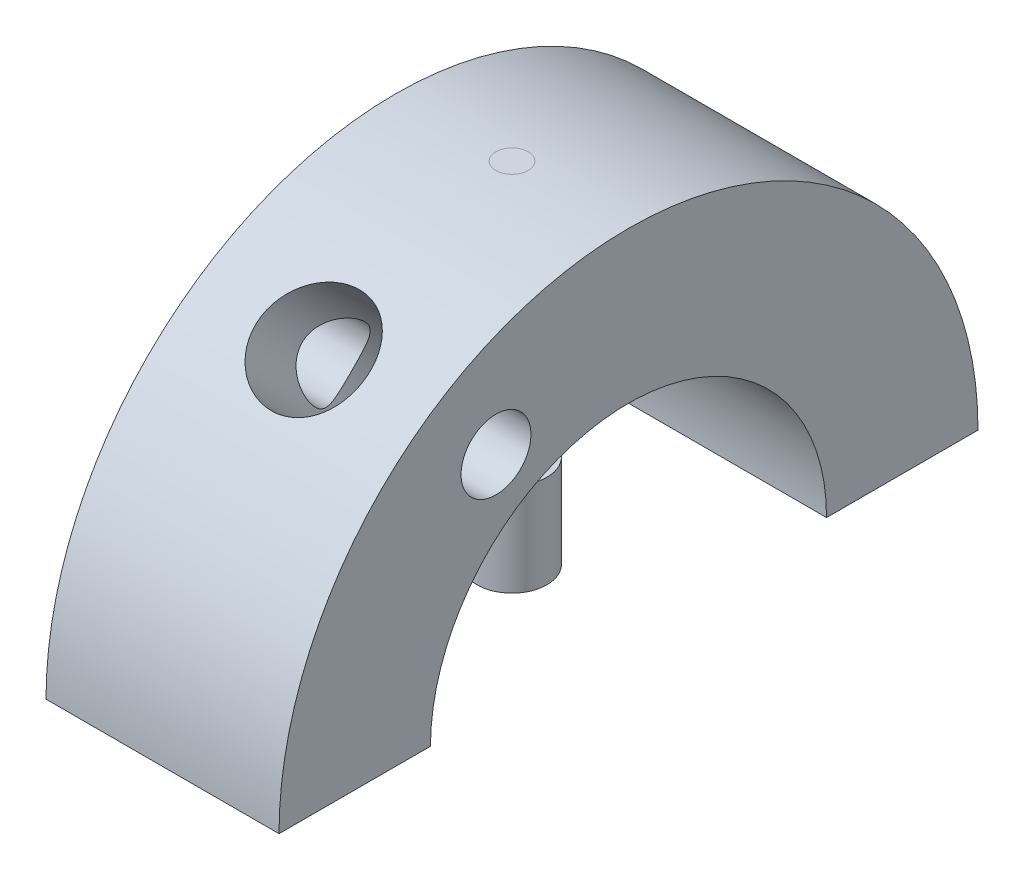
ISO-10303-21;
HEADER;
FILE_DESCRIPTION(('STEP AP214'),'2;1');
FILE_NAME('part.step','',(''),(''),'','','');
FILE_SCHEMA(('AUTOMOTIVE_DESIGN { 1 0 10303 214 1 1 1 1 }'));
ENDSEC;
DATA;
#1=APPLICATION_CONTEXT('core data for automotive mechanical design processes');
#2=APPLICATION_PROTOCOL_DEFINITION('international standard','automotive_design',2000,#1);
#3=PRODUCT_CONTEXT('',#1,'mechanical');
#4=PRODUCT('Part','Part','',(#3));
#5=PRODUCT_RELATED_PRODUCT_CATEGORY('part','',(#4));
#6=PRODUCT_DEFINITION_FORMATION('','',#4);
#7=PRODUCT_DEFINITION_CONTEXT('part definition',#1,'design');
#8=PRODUCT_DEFINITION('design','',#6,#7);
#9=PRODUCT_DEFINITION_SHAPE('','',#8);
#10=(LENGTH_UNIT() NAMED_UNIT(*) SI_UNIT(.MILLI.,.METRE.));
#11=(NAMED_UNIT(*) PLANE_ANGLE_UNIT() SI_UNIT($,.RADIAN.));
#12=(NAMED_UNIT(*) SI_UNIT($,.STERADIAN.) SOLID_ANGLE_UNIT());
#13=UNCERTAINTY_MEASURE_WITH_UNIT(LENGTH_MEASURE(1.E-05),#10,'distance_accuracy_value','');
#14=(GEOMETRIC_REPRESENTATION_CONTEXT(3) GLOBAL_UNCERTAINTY_ASSIGNED_CONTEXT((#13)) GLOBAL_UNIT_ASSIGNED_CONTEXT((#10,
#11,#12)) REPRESENTATION_CONTEXT('',''));
#15=CARTESIAN_POINT('',(0.,0.,0.));
#16=DIRECTION('',(0.,0.,1.));
#17=DIRECTION('',(1.,0.,0.));
#18=AXIS2_PLACEMENT_3D('',#15,#16,#17);
#19=CARTESIAN_POINT('',(5.,4.71939157702453,2.84369169369423));
#20=DIRECTION('',(-1.,0.,0.));
#21=DIRECTION('',(0.,0.,1.));
#22=AXIS2_PLACEMENT_3D('',#19,#20,#21);
#23=CYLINDRICAL_SURFACE('',#22,0.75000000000004);
#24=CARTESIAN_POINT('',(3.49816225997058,4.71939157702453,3.59369169369427));
#25=CARTESIAN_POINT('',(3.48237212943933,4.67736396111229,3.59369289298277));
#26=CARTESIAN_POINT('',(3.46624591516442,4.6354628448524,3.59016862420385));
#27=CARTESIAN_POINT('',(3.43487477704927,4.55241755000423,3.57608183252369));
#28=CARTESIAN_POINT('',(3.41963122359208,4.51127461265265,3.56550866824495));
#29=CARTESIAN_POINT('',(3.39449175583129,4.4378545444608,3.5397251222914));
#30=CARTESIAN_POINT('',(3.38412739388799,4.40532334575282,3.52570432936178));
#31=CARTESIAN_POINT('',(3.36654412734135,4.34195429182068,3.49277640099904));
#32=CARTESIAN_POINT('',(3.35931888166515,4.31111313391921,3.47387924023808));
#33=CARTESIAN_POINT('',(3.34910438377939,4.25174202860566,3.43118645824184));
#34=CARTESIAN_POINT('',(3.34615531979401,4.22323635421569,3.40734674039403));
#35=CARTESIAN_POINT('',(3.34522443028787,4.17004900254024,3.35564547767005));
#36=CARTESIAN_POINT('',(3.34724117411191,4.14536622605099,3.32778509332978));
#37=CARTESIAN_POINT('',(3.35522179453892,4.10376336776317,3.27324411703564));
#38=CARTESIAN_POINT('',(3.36060548033694,4.08624271962958,3.24692707629194));
#39=CARTESIAN_POINT('',(3.37403808335899,4.05487241921787,3.19282438887733));
#40=CARTESIAN_POINT('',(3.38208949648278,4.04102622665533,3.16503738746179));
#41=CARTESIAN_POINT('',(3.40370003976544,4.01213211459998,3.09697720753481));
#42=CARTESIAN_POINT('',(3.41816700781691,3.99888960836257,3.05622595793514));
#43=CARTESIAN_POINT('',(3.44869686017129,3.97951111088094,2.97362371921428));
#44=CARTESIAN_POINT('',(3.46476246085175,3.97338744771444,2.93177095028921));
#45=CARTESIAN_POINT('',(3.49698954182701,3.96818270721996,2.84701004923407));
#46=CARTESIAN_POINT('',(3.51314940313484,3.9691975088883,2.80409529421488));
#47=CARTESIAN_POINT('',(3.54378596275056,3.97866365693903,2.71851055604212));
#48=CARTESIAN_POINT('',(3.55826497102016,3.98710465735402,2.6758403154497));
#49=CARTESIAN_POINT('',(3.58209384194274,4.00969168439556,2.59835851516028));
#50=CARTESIAN_POINT('',(3.59189207114356,4.02273419236296,2.56336476708593));
#51=CARTESIAN_POINT('',(3.60849852410238,4.05424275862494,2.49514353852549));
#52=CARTESIAN_POINT('',(3.61530859811178,4.072705448913,2.461914976281));
#53=CARTESIAN_POINT('',(3.62533718902761,4.11488477667376,2.39811342092209));
#54=CARTESIAN_POINT('',(3.6285379725357,4.13862667534068,2.36755421449405));
#55=CARTESIAN_POINT('',(3.63095427809722,4.19063922894926,2.31038800414979));
#56=CARTESIAN_POINT('',(3.63017081286046,4.2189087313029,2.28377999769356));
#57=CARTESIAN_POINT('',(3.62493748160135,4.27645161057037,2.23742870899553));
#58=CARTESIAN_POINT('',(3.62079940833965,4.30544378176656,2.21729762156338));
#59=CARTESIAN_POINT('',(3.60960535647501,4.3655302894997,2.18149381618334));
#60=CARTESIAN_POINT('',(3.60254881696616,4.39662502917201,2.16582195624121));
#61=CARTESIAN_POINT('',(3.58567655930094,4.46155715825464,2.13848332957282));
#62=CARTESIAN_POINT('',(3.57575026487852,4.49545497813821,2.12703032289721));
#63=CARTESIAN_POINT('',(3.55401240924106,4.56394196604911,2.10912389423604));
#64=CARTESIAN_POINT('',(3.54220033084236,4.5985313214497,2.10267184663357));
#65=CARTESIAN_POINT('',(3.51557652463702,4.67312792667596,2.09404130614981));
#66=CARTESIAN_POINT('',(3.50058148677714,4.71316188263108,2.09265859347055));
#67=CARTESIAN_POINT('',(3.47032361144534,4.79291947487792,2.09623523392138));
#68=CARTESIAN_POINT('',(3.455060296278,4.83264232568673,2.10120734017921));
#69=CARTESIAN_POINT('',(3.42386440343967,4.91613211416066,2.11854839176209));
#70=CARTESIAN_POINT('',(3.40808509474779,4.95978681352525,2.13176118834984));
#71=CARTESIAN_POINT('',(3.38051916598163,5.04496805618071,2.16649436946363));
#72=CARTESIAN_POINT('',(3.36871877958408,5.08650150630369,2.18798554757666));
#73=CARTESIAN_POINT('',(3.35453151268342,5.15288844556569,2.23083148512887));
#74=CARTESIAN_POINT('',(3.35033322354781,5.17878512434709,2.24997290142108));
#75=CARTESIAN_POINT('',(3.34557480723508,5.22807036989122,2.29161995062206));
#76=CARTESIAN_POINT('',(3.34501056221703,5.25146174590671,2.31412174618172));
#77=CARTESIAN_POINT('',(3.34760451736375,5.2950225200128,2.36182788357609));
#78=CARTESIAN_POINT('',(3.35076072169672,5.31519363901896,2.38703076982212));
#79=CARTESIAN_POINT('',(3.36031865537089,5.35190863435309,2.43940421676841));
#80=CARTESIAN_POINT('',(3.36672499150669,5.36844731418543,2.46657752339127));
#81=CARTESIAN_POINT('',(3.38431858221963,5.4021927095608,2.53069787695271));
#82=CARTESIAN_POINT('',(3.39636736356799,5.41807220596621,2.56810355267684));
#83=CARTESIAN_POINT('',(3.42280641820984,5.44349355761178,2.64421177465048));
#84=CARTESIAN_POINT('',(3.43720000051477,5.45302635817711,2.68291609135947));
#85=CARTESIAN_POINT('',(3.46701021380882,5.46598751652316,2.76173811658616));
#86=CARTESIAN_POINT('',(3.48244037695926,5.46930566938387,2.80186871024396));
#87=CARTESIAN_POINT('',(3.51270525311873,5.46947420437673,2.88237766076776));
#88=CARTESIAN_POINT('',(3.52753988250086,5.4663236813718,2.92275605151885));
#89=CARTESIAN_POINT('',(3.55692034363959,5.45265576460819,3.00760694395679));
#90=CARTESIAN_POINT('',(3.57125016806707,5.44135728513431,3.05203479249311));
#91=CARTESIAN_POINT('',(3.59599394033441,5.41033800225419,3.13901448135212));
#92=CARTESIAN_POINT('',(3.60641300538522,5.39062827764204,3.18156870844883));
#93=CARTESIAN_POINT('',(3.62090660434441,5.34631823885664,3.2573552962954));
#94=CARTESIAN_POINT('',(3.62565515452885,5.32275896174129,3.29106580336747));
#95=CARTESIAN_POINT('',(3.63068391566726,5.27023349542392,3.35433683931741));
#96=CARTESIAN_POINT('',(3.63096855093179,5.24127268864834,3.38390144849546));
#97=CARTESIAN_POINT('',(3.62731355588333,5.18323694166521,3.43413317957378));
#98=CARTESIAN_POINT('',(3.62393201237798,5.15469191100719,3.45546101844147));
#99=CARTESIAN_POINT('',(3.61410163741132,5.09525144997067,3.49367476888427));
#100=CARTESIAN_POINT('',(3.60765165389877,5.06435514046332,3.51055900840089));
#101=CARTESIAN_POINT('',(3.59199454748339,5.00025323959976,3.54003516619758));
#102=CARTESIAN_POINT('',(3.58272098605011,4.96700875404357,3.5525059597763));
#103=CARTESIAN_POINT('',(3.56216971256512,4.89972380938075,3.57253500237752));
#104=CARTESIAN_POINT('',(3.55089345777201,4.86568394456756,3.58009680492362));
#105=CARTESIAN_POINT('',(3.52596915449089,4.79421027852521,3.59090378420293));
#106=CARTESIAN_POINT('',(3.51219849165238,4.75675094861493,3.5936906276175));
#107=CARTESIAN_POINT('',(3.49816225997058,4.71939157702453,3.59369169369427));
#108=B_SPLINE_CURVE_WITH_KNOTS('',3,(#24,#25,#26,#27,#28,#29,#30,#31,#32,#33,#34,#35,#36,#37,
#38,#39,#40,#41,#42,#43,#44,#45,#46,#47,#48,#49,#50,#51,#52,#53,#54,#55,#56,#57,#58,#59,#60,#61,
#62,#63,#64,#65,#66,#67,#68,#69,#70,#71,#72,#73,#74,#75,#76,#77,#78,#79,#80,#81,#82,#83,#84,#85,
#86,#87,#88,#89,#90,#91,#92,#93,#94,#95,#96,#97,#98,#99,#100,#101,#102,#103,#104,#105,#106,
#107),.UNSPECIFIED.,.T.,.F.,(4,2,2,2,2,2,2,2,2,2,2,2,2,2,2,2,2,2,2,2,2,2,2,2,2,2,2,2,2,2,2,2,2,
2,2,2,2,2,2,2,2,4),(0.,0.134560488140848,0.269324577150457,0.379634868166853,0.489721282434197,
0.600835746311971,0.711918201724937,0.807743328874952,0.903658363434937,1.03861946689358,
1.17381394311348,1.31082769349624,1.44765086198446,1.56299660323653,1.67827082182157,
1.79410897841395,1.90991769292547,2.01605071390278,2.12220414228444,2.23316963269999,
2.34416560828254,2.47198188729179,2.60005507680382,2.74407366307326,2.88758873295769,
2.98458946918224,3.08148027168855,3.1783191208537,3.27529561622293,3.40177220870495,
3.52842885776014,3.65731100256988,3.78621118259463,3.92946144716935,4.07252361051078,
4.19597104572783,4.31929612100794,4.42618048152388,4.53310500367232,4.64277044295141,
4.75235640875996,4.87197050460438),.UNSPECIFIED.);
#109=CARTESIAN_POINT('',(3.49816225997058,4.71939157702453,3.59369169369427));
#110=VERTEX_POINT('',#109);
#111=EDGE_CURVE('E104',#110,#110,#108,.T.);
#112=ORIENTED_EDGE('',*,*,#111,.F.);
#113=EDGE_LOOP('',(#112));
#114=FACE_BOUND('',#113,.T.);
#115=CARTESIAN_POINT('',(5.,4.71939157702453,2.84369169369423));
#116=DIRECTION('',(1.,0.,0.));
#117=DIRECTION('',(0.,0.,-1.));
#118=AXIS2_PLACEMENT_3D('',#115,#116,#117);
#119=CIRCLE('',#118,0.75000000000004);
#120=CARTESIAN_POINT('',(5.,4.71939157702453,2.09369169369419));
#121=VERTEX_POINT('',#120);
#122=EDGE_CURVE('E208',#121,#121,#119,.T.);
#123=ORIENTED_EDGE('',*,*,#122,.T.);
#124=EDGE_LOOP('',(#123));
#125=FACE_BOUND('',#124,.T.);
#126=ADVANCED_FACE('F35',(#114,#125),#23,.F.);
#127=CARTESIAN_POINT('',(5.,0.,0.));
#128=DIRECTION('',(1.,0.,0.));
#129=DIRECTION('',(0.,0.,-1.));
#130=AXIS2_PLACEMENT_3D('',#127,#128,#129);
#131=PLANE('',#130);
#132=CARTESIAN_POINT('',(5.,0.,0.));
#133=DIRECTION('',(1.,0.,0.));
#134=DIRECTION('',(0.,0.,-1.));
#135=AXIS2_PLACEMENT_3D('',#132,#133,#134);
#136=CIRCLE('',#135,7.5);
#137=CARTESIAN_POINT('',(5.,0.,-7.5));
#138=VERTEX_POINT('',#137);
#139=CARTESIAN_POINT('',(5.,0.,7.5));
#140=VERTEX_POINT('',#139);
#141=EDGE_CURVE('E232',#138,#140,#136,.T.);
#142=ORIENTED_EDGE('',*,*,#141,.T.);
#143=DIRECTION('',(0.,0.,-1.));
#144=VECTOR('',#143,1.);
#145=CARTESIAN_POINT('',(5.,0.,7.5));
#146=LINE('',#145,#144);
#147=CARTESIAN_POINT('',(5.,0.,4.25));
#148=VERTEX_POINT('',#147);
#149=EDGE_CURVE('E240',#140,#148,#146,.T.);
#150=ORIENTED_EDGE('',*,*,#149,.T.);
#151=CARTESIAN_POINT('',(5.,0.,0.));
#152=DIRECTION('',(-1.,0.,0.));
#153=DIRECTION('',(0.,0.,-1.));
#154=AXIS2_PLACEMENT_3D('',#151,#152,#153);
#155=CIRCLE('',#154,4.25);
#156=CARTESIAN_POINT('',(5.,0.,-4.25));
#157=VERTEX_POINT('',#156);
#158=EDGE_CURVE('E243',#148,#157,#155,.T.);
#159=ORIENTED_EDGE('',*,*,#158,.T.);
#160=DIRECTION('',(0.,0.,-1.));
#161=VECTOR('',#160,1.);
#162=CARTESIAN_POINT('',(5.,0.,-4.25));
#163=LINE('',#162,#161);
#164=EDGE_CURVE('E245',#157,#138,#163,.T.);
#165=ORIENTED_EDGE('',*,*,#164,.T.);
#166=EDGE_LOOP('',(#142,#150,#159,#165));
#167=FACE_BOUND('',#166,.T.);
#168=ORIENTED_EDGE('',*,*,#122,.F.);
#169=EDGE_LOOP('',(#168));
#170=FACE_BOUND('',#169,.T.);
#171=ADVANCED_FACE('F174',(#167,#170),#131,.T.);
#172=CARTESIAN_POINT('',(0.,0.,0.));
#173=DIRECTION('',(1.,0.,0.));
#174=DIRECTION('',(0.,0.,-1.));
#175=AXIS2_PLACEMENT_3D('',#172,#173,#174);
#176=PLANE('',#175);
#177=CARTESIAN_POINT('',(0.,0.,0.));
#178=DIRECTION('',(1.,0.,0.));
#179=DIRECTION('',(0.,0.,-1.));
#180=AXIS2_PLACEMENT_3D('',#177,#178,#179);
#181=CIRCLE('',#180,7.5);
#182=CARTESIAN_POINT('',(0.,0.,-7.5));
#183=VERTEX_POINT('',#182);
#184=CARTESIAN_POINT('',(0.,0.,7.5));
#185=VERTEX_POINT('',#184);
#186=EDGE_CURVE('E248',#183,#185,#181,.T.);
#187=ORIENTED_EDGE('',*,*,#186,.F.);
#188=DIRECTION('',(0.,0.,-1.));
#189=VECTOR('',#188,1.);
#190=CARTESIAN_POINT('',(0.,0.,-4.25));
#191=LINE('',#190,#189);
#192=CARTESIAN_POINT('',(0.,0.,-4.25));
#193=VERTEX_POINT('',#192);
#194=EDGE_CURVE('E241',#193,#183,#191,.T.);
#195=ORIENTED_EDGE('',*,*,#194,.F.);
#196=CARTESIAN_POINT('',(0.,0.,0.));
#197=DIRECTION('',(-1.,0.,0.));
#198=DIRECTION('',(0.,0.,-1.));
#199=AXIS2_PLACEMENT_3D('',#196,#197,#198);
#200=CIRCLE('',#199,4.25);
#201=CARTESIAN_POINT('',(0.,0.,4.25));
#202=VERTEX_POINT('',#201);
#203=EDGE_CURVE('E253',#202,#193,#200,.T.);
#204=ORIENTED_EDGE('',*,*,#203,.F.);
#205=DIRECTION('',(0.,0.,-1.));
#206=VECTOR('',#205,1.);
#207=CARTESIAN_POINT('',(0.,0.,7.5));
#208=LINE('',#207,#206);
#209=EDGE_CURVE('E251',#185,#202,#208,.T.);
#210=ORIENTED_EDGE('',*,*,#209,.F.);
#211=EDGE_LOOP('',(#187,#195,#204,#210));
#212=FACE_BOUND('',#211,.T.);
#213=CARTESIAN_POINT('',(0.,4.71939157702453,2.84369169369423));
#214=DIRECTION('',(1.,0.,0.));
#215=DIRECTION('',(0.,0.,-1.));
#216=AXIS2_PLACEMENT_3D('',#213,#214,#215);
#217=CIRCLE('',#216,0.75000000000004);
#218=CARTESIAN_POINT('',(0.,4.71939157702453,2.09369169369419));
#219=VERTEX_POINT('',#218);
#220=EDGE_CURVE('E107',#219,#219,#217,.T.);
#221=ORIENTED_EDGE('',*,*,#220,.T.);
#222=EDGE_LOOP('',(#221));
#223=FACE_BOUND('',#222,.T.);
#224=ADVANCED_FACE('F177',(#212,#223),#176,.F.);
#225=CARTESIAN_POINT('',(5.,0.,0.));
#226=DIRECTION('',(-1.,0.,0.));
#227=DIRECTION('',(0.,0.,1.));
#228=AXIS2_PLACEMENT_3D('',#225,#226,#227);
#229=CYLINDRICAL_SURFACE('',#228,7.5);
#230=CARTESIAN_POINT('',(2.49999971032793,5.44009637527457,5.16288208539808));
#231=CARTESIAN_POINT('',(2.43655210357065,5.44009856844284,5.16288072608623));
#232=CARTESIAN_POINT('',(2.37306796611011,5.44379103398096,5.15899764604712));
#233=CARTESIAN_POINT('',(2.24785683341275,5.45842003253968,5.14351631338225));
#234=CARTESIAN_POINT('',(2.18613159268531,5.46936355168089,5.13191062025978));
#235=CARTESIAN_POINT('',(2.06625159044542,5.49804187344908,5.10117387281443));
#236=CARTESIAN_POINT('',(2.00809567259744,5.51577446303592,5.08204527068652));
#237=CARTESIAN_POINT('',(1.89700637144207,5.55730266038018,5.03659905658001));
#238=CARTESIAN_POINT('',(1.84407191964891,5.58109702411147,5.01028291958172));
#239=CARTESIAN_POINT('',(1.74498421380234,5.63375869964356,4.95099265686791));
#240=CARTESIAN_POINT('',(1.69882248223334,5.66261956843805,4.91802697944183));
#241=CARTESIAN_POINT('',(1.61451297165337,5.72429889757693,4.84609550305148));
#242=CARTESIAN_POINT('',(1.57636510754421,5.7571173158908,4.80712976780863));
#243=CARTESIAN_POINT('',(1.50925804391401,5.82534683651055,4.72421453496729));
#244=CARTESIAN_POINT('',(1.48026914046351,5.86074908942937,4.68028178896922));
#245=CARTESIAN_POINT('',(1.43207088382563,5.93296062390153,4.58839725385902));
#246=CARTESIAN_POINT('',(1.41286141492737,5.96976988880147,4.54044551230773));
#247=CARTESIAN_POINT('',(1.38462280018413,6.04365194091494,4.44163085989954));
#248=CARTESIAN_POINT('',(1.37561954381754,6.08072515930492,4.39076088804347));
#249=CARTESIAN_POINT('',(1.36799332023557,6.15391476531423,4.28757915571534));
#250=CARTESIAN_POINT('',(1.36937124831164,6.19003107013812,4.23526727127786));
#251=CARTESIAN_POINT('',(1.38244403516166,6.26095733493298,4.12971264168689));
#252=CARTESIAN_POINT('',(1.39431791247656,6.29573364961571,4.07646953067359));
#253=CARTESIAN_POINT('',(1.42818976610592,6.36249138746405,3.9714705108625));
#254=CARTESIAN_POINT('',(1.45018944139501,6.39447234053313,3.91971485318856));
#255=CARTESIAN_POINT('',(1.50436979706559,6.45578951976445,3.81790574063428));
#256=CARTESIAN_POINT('',(1.53679666072206,6.48503709736733,3.7679297649937));
#257=CARTESIAN_POINT('',(1.61078811040438,6.53942872356669,3.67272142161259));
#258=CARTESIAN_POINT('',(1.65235379833791,6.5645722766856,3.62748962687077));
#259=CARTESIAN_POINT('',(1.74393119003945,6.61053742182015,3.54303926695542));
#260=CARTESIAN_POINT('',(1.79400333060076,6.63132552709779,3.50386785790167));
#261=CARTESIAN_POINT('',(1.90108175552657,6.66802202702749,3.43352031308244));
#262=CARTESIAN_POINT('',(1.95808669014517,6.68393136940882,3.40234262468138));
#263=CARTESIAN_POINT('',(2.07554387997925,6.71019306108089,3.35024438509569));
#264=CARTESIAN_POINT('',(2.13582987709249,6.72070538294297,3.32903037140707));
#265=CARTESIAN_POINT('',(2.25964071924158,6.7367353336,3.2964725813908));
#266=CARTESIAN_POINT('',(2.32316434111982,6.74225483409651,3.28512510637152));
#267=CARTESIAN_POINT('',(2.44825821805446,6.74805432427448,3.27319472571568));
#268=CARTESIAN_POINT('',(2.50976932432054,6.74858035294537,3.27210635205765));
#269=CARTESIAN_POINT('',(2.63208291708383,6.74502517473172,3.27942857360736));
#270=CARTESIAN_POINT('',(2.69288548529153,6.74094450452406,3.2878380623215));
#271=CARTESIAN_POINT('',(2.81094235705661,6.72836182246676,3.3135093211086));
#272=CARTESIAN_POINT('',(2.86824085393282,6.71994079959886,3.33060885971715));
#273=CARTESIAN_POINT('',(2.97896889247174,6.69885363291009,3.3728198138711));
#274=CARTESIAN_POINT('',(3.03239791857443,6.68618692466395,3.39793229464298));
#275=CARTESIAN_POINT('',(3.13568295129766,6.65632775520325,3.45606673983776));
#276=CARTESIAN_POINT('',(3.18537811700802,6.63900785856951,3.48930859281373));
#277=CARTESIAN_POINT('',(3.27816424389655,6.60027249608846,3.56203565422818));
#278=CARTESIAN_POINT('',(3.32125355924555,6.57885601256567,3.6015224136053));
#279=CARTESIAN_POINT('',(3.40179716828469,6.53106861730094,3.6875022952365));
#280=CARTESIAN_POINT('',(3.43887433303018,6.50450706978643,3.73424314044457));
#281=CARTESIAN_POINT('',(3.50381120587202,6.44759873648959,3.83166428580837));
#282=CARTESIAN_POINT('',(3.53166938942838,6.41725132578169,3.88234523582839));
#283=CARTESIAN_POINT('',(3.5779834641853,6.35252330657916,3.98739795308558));
#284=CARTESIAN_POINT('',(3.59619027588066,6.31806162875601,4.04182994669176));
#285=CARTESIAN_POINT('',(3.6215189267503,6.24651465913623,4.15154681177877));
#286=CARTESIAN_POINT('',(3.62864144695947,6.20942952867471,4.20683163064999));
#287=CARTESIAN_POINT('',(3.63142577826501,6.13409968005638,4.31591952885175));
#288=CARTESIAN_POINT('',(3.62722521024061,6.0958744205597,4.36973244284154));
#289=CARTESIAN_POINT('',(3.60761881649457,6.01903224317763,4.47498555884259));
#290=CARTESIAN_POINT('',(3.59221469952475,5.98041538590382,4.52642612140988));
#291=CARTESIAN_POINT('',(3.55107682328808,5.90512744546232,4.62419538376398));
#292=CARTESIAN_POINT('',(3.52561955695407,5.86843186515152,4.67062167004561));
#293=CARTESIAN_POINT('',(3.46505297421318,5.79728544664297,4.75864339163591));
#294=CARTESIAN_POINT('',(3.42994471232834,5.76283436370725,4.80023935402702));
#295=CARTESIAN_POINT('',(3.35163031598293,5.69796700955784,4.87705532159691));
#296=CARTESIAN_POINT('',(3.30854684865972,5.66750018993392,4.91235781930968));
#297=CARTESIAN_POINT('',(3.21516523596131,5.61120658403268,4.97656393736505));
#298=CARTESIAN_POINT('',(3.16486571527156,5.58538068439119,5.00546633522947));
#299=CARTESIAN_POINT('',(3.05848382406282,5.53939934428487,5.05630633735236));
#300=CARTESIAN_POINT('',(3.00240063599814,5.51924470698223,5.07824295517594));
#301=CARTESIAN_POINT('',(2.88607578761608,5.48543886664448,5.11474186090413));
#302=CARTESIAN_POINT('',(2.82583809368954,5.47178155625379,5.12931107483322));
#303=CARTESIAN_POINT('',(2.72113770195546,5.45450658155937,5.14766565315889));
#304=CARTESIAN_POINT('',(2.67728502174115,5.44911362077977,5.15336671765801));
#305=CARTESIAN_POINT('',(2.58896078636299,5.44190774264679,5.16097541677924));
#306=CARTESIAN_POINT('',(2.54448922910283,5.44009483742301,5.16288303854878));
#307=CARTESIAN_POINT('',(2.49999971032793,5.44009637527457,5.16288208539808));
#308=B_SPLINE_CURVE_WITH_KNOTS('',3,(#230,#231,#232,#233,#234,#235,#236,#237,#238,#239,#240,
#241,#242,#243,#244,#245,#246,#247,#248,#249,#250,#251,#252,#253,#254,#255,#256,#257,#258,#259,
#260,#261,#262,#263,#264,#265,#266,#267,#268,#269,#270,#271,#272,#273,#274,#275,#276,#277,#278,
#279,#280,#281,#282,#283,#284,#285,#286,#287,#288,#289,#290,#291,#292,#293,#294,#295,#296,#297,
#298,#299,#300,#301,#302,#303,#304,#305,#306,#307),.UNSPECIFIED.,.T.,.F.,(4,2,2,2,2,2,2,2,2,2,2,
2,2,2,2,2,2,2,2,2,2,2,2,2,2,2,2,2,2,2,2,2,2,2,2,2,2,2,4),(0.,0.19018183288868,0.380547165860463,
0.5708504980133,0.761114806628332,0.951138888636627,1.14116095270233,1.33056026482162,
1.51995733590423,1.70983377144608,1.89972658245019,2.09292206988094,2.28614998477611,
2.4843238354444,2.68252159391039,2.88219139271718,3.08182237984859,3.27513370860352,
3.468372539022,3.65203750878055,3.83568108391922,4.01601575041697,4.19637440028369,
4.38229090762762,4.5682536605343,4.76328242259313,4.95834342039825,5.15821965378282,
5.35808360599781,5.55552939725232,5.75294508062539,5.94527214993936,6.13757821286391,
6.32714088615676,6.51673973649786,6.70636542426408,6.89581251381531,7.02916773382193,
7.16252340564914),.UNSPECIFIED.);
#309=CARTESIAN_POINT('',(2.49999971032793,5.44009637527457,5.16288208539808));
#310=VERTEX_POINT('',#309);
#311=EDGE_CURVE('E103',#310,#310,#308,.T.);
#312=ORIENTED_EDGE('',*,*,#311,.T.);
#313=EDGE_LOOP('',(#312));
#314=FACE_BOUND('',#313,.T.);
#315=CARTESIAN_POINT('',(2.153125,7.5,0.));
#316=CARTESIAN_POINT('',(2.153125,7.5,0.14332711173528));
#317=CARTESIAN_POINT('',(2.25472233527592,7.5,0.245277664724084));
#318=CARTESIAN_POINT('',(2.35571817102748,7.5,0.346624626989139));
#319=CARTESIAN_POINT('',(2.5,7.5,0.346875));
#320=CARTESIAN_POINT('',(2.64307796460178,7.5,0.347123283938735));
#321=CARTESIAN_POINT('',(2.74527766472408,7.5,0.245277664724084));
#322=CARTESIAN_POINT('',(2.846875,7.5,0.144032323403592));
#323=CARTESIAN_POINT('',(2.846875,7.5,0.));
#324=B_SPLINE_CURVE_WITH_KNOTS('',2,(#315,#316,#317,#318,#319,#320,#321,#322,#323),
.UNSPECIFIED.,.F.,.F.,(3,2,2,2,3),(0.,0.25,0.5,0.75,1.),.UNSPECIFIED.);
#325=CARTESIAN_POINT('',(2.153125,7.5,0.));
#326=VERTEX_POINT('',#325);
#327=CARTESIAN_POINT('',(2.846875,7.5,0.));
#328=VERTEX_POINT('',#327);
#329=EDGE_CURVE('E155',#326,#328,#324,.T.);
#330=ORIENTED_EDGE('',*,*,#329,.F.);
#331=CARTESIAN_POINT('',(2.846875,7.5,0.));
#332=CARTESIAN_POINT('',(2.846875,7.5,-0.143331097949444));
#333=CARTESIAN_POINT('',(2.74527766472408,7.5,-0.245277664724084));
#334=CARTESIAN_POINT('',(2.64427505729752,7.5,-0.346627459327066));
#335=CARTESIAN_POINT('',(2.5,7.5,-0.346875));
#336=CARTESIAN_POINT('',(2.35691524433554,7.5,-0.347120498406774));
#337=CARTESIAN_POINT('',(2.25472233527592,7.5,-0.245277664724084));
#338=CARTESIAN_POINT('',(2.153125,7.5,-0.144028364608036));
#339=CARTESIAN_POINT('',(2.153125,7.5,0.));
#340=B_SPLINE_CURVE_WITH_KNOTS('',2,(#331,#332,#333,#334,#335,#336,#337,#338,#339),
.UNSPECIFIED.,.F.,.F.,(3,2,2,2,3),(0.,0.25,0.5,0.75,1.),.UNSPECIFIED.);
#341=EDGE_CURVE('E61',#328,#326,#340,.T.);
#342=ORIENTED_EDGE('',*,*,#341,.F.);
#343=EDGE_LOOP('',(#330,#342));
#344=FACE_BOUND('',#343,.T.);
#345=ORIENTED_EDGE('',*,*,#186,.T.);
#346=DIRECTION('',(-1.,0.,0.));
#347=VECTOR('',#346,1.);
#348=CARTESIAN_POINT('',(5.,0.,7.5));
#349=LINE('',#348,#347);
#350=EDGE_CURVE('E49',#140,#185,#349,.T.);
#351=ORIENTED_EDGE('',*,*,#350,.F.);
#352=ORIENTED_EDGE('',*,*,#141,.F.);
#353=DIRECTION('',(-1.,0.,0.));
#354=VECTOR('',#353,1.);
#355=CARTESIAN_POINT('',(5.,0.,-7.5));
#356=LINE('',#355,#354);
#357=EDGE_CURVE('E247',#138,#183,#356,.T.);
#358=ORIENTED_EDGE('',*,*,#357,.T.);
#359=EDGE_LOOP('',(#345,#351,#352,#358));
#360=FACE_BOUND('',#359,.T.);
#361=ADVANCED_FACE('F37',(#314,#344,#360),#229,.T.);
#362=CARTESIAN_POINT('',(5.,0.,7.5));
#363=DIRECTION('',(0.,1.,0.));
#364=DIRECTION('',(0.,0.,1.));
#365=AXIS2_PLACEMENT_3D('',#362,#363,#364);
#366=PLANE('',#365);
#367=ORIENTED_EDGE('',*,*,#209,.T.);
#368=DIRECTION('',(-1.,0.,0.));
#369=VECTOR('',#368,1.);
#370=CARTESIAN_POINT('',(5.,0.,4.25));
#371=LINE('',#370,#369);
#372=EDGE_CURVE('E260',#148,#202,#371,.T.);
#373=ORIENTED_EDGE('',*,*,#372,.F.);
#374=ORIENTED_EDGE('',*,*,#149,.F.);
#375=ORIENTED_EDGE('',*,*,#350,.T.);
#376=EDGE_LOOP('',(#367,#373,#374,#375));
#377=FACE_BOUND('',#376,.T.);
#378=ADVANCED_FACE('F186',(#377),#366,.F.);
#379=CARTESIAN_POINT('',(5.,0.,0.));
#380=DIRECTION('',(-1.,0.,0.));
#381=DIRECTION('',(0.,0.,1.));
#382=AXIS2_PLACEMENT_3D('',#379,#380,#381);
#383=CYLINDRICAL_SURFACE('',#382,4.25);
#384=CARTESIAN_POINT('',(1.36950017659453,4.17964639494934,0.770101300600764));
#385=CARTESIAN_POINT('',(1.74633351084793,4.17964638082618,0.770101377252749));
#386=CARTESIAN_POINT('',(2.12316684510134,4.17964636670302,0.770101453904733));
#387=CARTESIAN_POINT('',(2.87683351360814,4.1796463384567,0.770101607208701));
#388=CARTESIAN_POINT('',(3.25366684786154,4.17964632433354,0.770101683860686));
#389=CARTESIAN_POINT('',(3.63050018211494,4.17964631021039,0.77010176051267));
#390=B_SPLINE_CURVE_WITH_KNOTS('',3,(#384,#385,#386,#387,#388,#389),.UNSPECIFIED.,.F.,.F.,(4,2,
4),(0.,1.13050000276023,2.26100000552045),.UNSPECIFIED.);
#391=CARTESIAN_POINT('',(2.18182125060567,4.17964636450475,0.770101465835668));
#392=VERTEX_POINT('',#391);
#393=CARTESIAN_POINT('',(2.81817947759072,4.17964634065498,0.770101595277823));
#394=VERTEX_POINT('',#393);
#395=EDGE_CURVE('E11',#392,#394,#390,.T.);
#396=ORIENTED_EDGE('',*,*,#395,.F.);
#397=CARTESIAN_POINT('',(2.18182125060567,4.17964636450475,0.770101465835667));
#398=CARTESIAN_POINT('',(2.12065054761202,4.17569837819489,0.791501369726221));
#399=CARTESIAN_POINT('',(2.06184087274917,4.17052739148107,0.818695572769668));
#400=CARTESIAN_POINT('',(1.95025439266109,4.15751247161361,0.882407613241222));
#401=CARTESIAN_POINT('',(1.89744443888157,4.14968428512478,0.918870213207987));
#402=CARTESIAN_POINT('',(1.79863394827727,4.13112584516693,0.998988918671638));
#403=CARTESIAN_POINT('',(1.7526066238438,4.12040750864556,1.04261520356305));
#404=CARTESIAN_POINT('',(1.66752813194102,4.09577468178119,1.13553773611219));
#405=CARTESIAN_POINT('',(1.62848992386356,4.08185436119108,1.18484424368846));
#406=CARTESIAN_POINT('',(1.55367348374622,4.04870437792298,1.29387636754479));
#407=CARTESIAN_POINT('',(1.51887017581724,4.02903474148969,1.35413971678567));
#408=CARTESIAN_POINT('',(1.45954267315607,3.98525682658899,1.47802035343707));
#409=CARTESIAN_POINT('',(1.43501826322849,3.9611486410607,1.54163757060081));
#410=CARTESIAN_POINT('',(1.39639157483475,3.90757970425581,1.67287960587822));
#411=CARTESIAN_POINT('',(1.38272269641782,3.87794981094311,1.74056471698741));
#412=CARTESIAN_POINT('',(1.36840032000091,3.81456787919278,1.87539595697156));
#413=CARTESIAN_POINT('',(1.36774117643089,3.7808176351779,1.94254230699632));
#414=CARTESIAN_POINT('',(1.37971248145127,3.71280755368666,2.06939083616345));
#415=CARTESIAN_POINT('',(1.39142130666329,3.67874662055985,2.12928588200152));
#416=CARTESIAN_POINT('',(1.42685951309774,3.60948213147729,2.24469647565915));
#417=CARTESIAN_POINT('',(1.45058263907974,3.57427917903112,2.30021428511906));
#418=CARTESIAN_POINT('',(1.50729806197214,3.50722942550117,2.40108955980564));
#419=CARTESIAN_POINT('',(1.53942885746522,3.47533406654246,2.44690107623337));
#420=CARTESIAN_POINT('',(1.61272289184989,3.41362879406582,2.53227462955554));
#421=CARTESIAN_POINT('',(1.6538847992124,3.38381857397277,2.57183758624782));
#422=CARTESIAN_POINT('',(1.7428524339057,3.32855155217199,2.64295756006823));
#423=CARTESIAN_POINT('',(1.7904508980194,3.30299960043568,2.6747004843033));
#424=CARTESIAN_POINT('',(1.89175554121887,3.25656279578242,2.73105026598603));
#425=CARTESIAN_POINT('',(1.94546182574995,3.23567802345804,2.75565700020856));
#426=CARTESIAN_POINT('',(2.0578510594441,3.19949689880766,2.79758743940388));
#427=CARTESIAN_POINT('',(2.11656466472298,3.18423854543457,2.81486173772824));
#428=CARTESIAN_POINT('',(2.23700955318098,3.16028033017728,2.84173443328892));
#429=CARTESIAN_POINT('',(2.29874096201201,3.15158074162767,2.851332510622));
#430=CARTESIAN_POINT('',(2.42400714130803,3.14114318727365,2.86282758368633));
#431=CARTESIAN_POINT('',(2.48755249133095,3.13946238100077,2.86466135012899));
#432=CARTESIAN_POINT('',(2.61416256393213,3.14330718938102,2.86044183942417));
#433=CARTESIAN_POINT('',(2.67722727443168,3.14883298454297,2.85438836471944));
#434=CARTESIAN_POINT('',(2.80119862840396,3.16681963134704,2.83441924580085));
#435=CARTESIAN_POINT('',(2.86210131433652,3.17929256690477,2.82048990159062));
#436=CARTESIAN_POINT('',(2.97989351676219,3.21053457514884,2.78487441301416));
#437=CARTESIAN_POINT('',(3.03678304602892,3.22930362779396,2.76318829333857));
#438=CARTESIAN_POINT('',(3.14476205068945,3.27211048279487,2.71235867432609));
#439=CARTESIAN_POINT('',(3.19586696796776,3.29613373053145,2.68323573905217));
#440=CARTESIAN_POINT('',(3.29097724107189,3.34825342214884,2.61790747461258));
#441=CARTESIAN_POINT('',(3.33498334825214,3.37634943436044,2.58170289588303));
#442=CARTESIAN_POINT('',(3.41427337864684,3.43492832756955,2.50322537893765));
#443=CARTESIAN_POINT('',(3.44963584137272,3.46538612707101,2.46101305815903));
#444=CARTESIAN_POINT('',(3.51126072304361,3.52747076045562,2.37116580395025));
#445=CARTESIAN_POINT('',(3.5375239211849,3.55909749398276,2.32353133529859));
#446=CARTESIAN_POINT('',(3.58035761354805,3.62203670698064,2.22413967673657));
#447=CARTESIAN_POINT('',(3.59695731514753,3.65334984930078,2.17239545283788));
#448=CARTESIAN_POINT('',(3.62046667753307,3.71457162971391,2.06596898167328));
#449=CARTESIAN_POINT('',(3.62737485568617,3.74448005223315,2.0112862862011));
#450=CARTESIAN_POINT('',(3.63179444991232,3.80294066040237,1.89850206058379));
#451=CARTESIAN_POINT('',(3.62898303939026,3.83141375113988,1.84034737419049));
#452=CARTESIAN_POINT('',(3.61376126040299,3.88521977730482,1.72385898772143));
#453=CARTESIAN_POINT('',(3.60134882095164,3.91055203387179,1.66552525172817));
#454=CARTESIAN_POINT('',(3.56626523530151,3.95953809947121,1.54565889355402));
#455=CARTESIAN_POINT('',(3.54288362630616,3.98291637645596,1.48422178695321));
#456=CARTESIAN_POINT('',(3.48649222563706,4.02555825771632,1.3643452305209));
#457=CARTESIAN_POINT('',(3.45347157200996,4.04481717735333,1.30590925040928));
#458=CARTESIAN_POINT('',(3.37574978669448,4.08058825221665,1.18964773874663));
#459=CARTESIAN_POINT('',(3.33037088948805,4.09679640466911,1.13217958736812));
#460=CARTESIAN_POINT('',(3.23017320494321,4.12489216582869,1.02509579310675));
#461=CARTESIAN_POINT('',(3.17537646045641,4.1367896661096,0.975462321863049));
#462=CARTESIAN_POINT('',(3.07123207222688,4.15435616924698,0.897239200080383));
#463=CARTESIAN_POINT('',(3.02367510840448,4.16083317637533,0.866450540953763));
#464=CARTESIAN_POINT('',(2.92408631102405,4.17174290112543,0.812291806496324));
#465=CARTESIAN_POINT('',(2.8720385804797,4.17616797076101,0.788949584774389));
#466=CARTESIAN_POINT('',(2.81817947759072,4.17964634065498,0.770101595277821));
#467=B_SPLINE_CURVE_WITH_KNOTS('',3,(#397,#398,#399,#400,#401,#402,#403,#404,#405,#406,#407,
#408,#409,#410,#411,#412,#413,#414,#415,#416,#417,#418,#419,#420,#421,#422,#423,#424,#425,#426,
#427,#428,#429,#430,#431,#432,#433,#434,#435,#436,#437,#438,#439,#440,#441,#442,#443,#444,#445,
#446,#447,#448,#449,#450,#451,#452,#453,#454,#455,#456,#457,#458,#459,#460,#461,#462,#463,#464,
#465,#466),.UNSPECIFIED.,.F.,.F.,(4,2,2,2,2,2,2,2,2,2,2,2,2,2,2,2,2,2,2,2,2,2,2,2,2,2,2,2,2,2,2,
2,2,2,4),(0.,0.194127981704686,0.387125075795185,0.579338242519437,0.77190420539909,
0.987905361786433,1.20390199582385,1.42814069983562,1.65228209339722,1.86082561068935,
2.06926066134453,2.26153147284672,2.45377395535161,2.64087205832417,2.82797339184616,
3.01631615455667,3.20466676596279,3.39454831046641,3.58443461115769,3.77465223785996,
3.96486925908467,4.15456588830525,4.34424242640477,4.53212544597454,4.71999237260012,
4.90728849372452,5.09461326474421,5.28821878014884,5.48186606880425,5.69028829476469,
5.89894629823239,6.12286853352339,6.3462736347103,6.5166856177033,6.68772775400653),.UNSPECIFIED.);
#468=EDGE_CURVE('E98',#392,#394,#467,.T.);
#469=ORIENTED_EDGE('',*,*,#468,.T.);
#470=EDGE_LOOP('',(#396,#469));
#471=FACE_BOUND('',#470,.T.);
#472=CARTESIAN_POINT('',(2.5,4.23582078638544,0.346875));
#473=CARTESIAN_POINT('',(2.51944927456005,4.23582097441726,0.346874149765423));
#474=CARTESIAN_POINT('',(2.53891182507866,4.23595618384105,0.345233716753323));
#475=CARTESIAN_POINT('',(2.57729852494445,4.23648241341559,0.338713809334074));
#476=CARTESIAN_POINT('',(2.59622203719357,4.23687372414983,0.333830655504997));
#477=CARTESIAN_POINT('',(2.63296912993705,4.23786754202239,0.320967383361725));
#478=CARTESIAN_POINT('',(2.65079332346407,4.23846993017837,0.312989009522658));
#479=CARTESIAN_POINT('',(2.68484524851443,4.2398178797952,0.29416485193845));
#480=CARTESIAN_POINT('',(2.70107332256515,4.24056341043584,0.283319685257569));
#481=CARTESIAN_POINT('',(2.73151668649633,4.24211570942485,0.259040848218836));
#482=CARTESIAN_POINT('',(2.74572749526485,4.24292260817692,0.245601566804193));
#483=CARTESIAN_POINT('',(2.77169444956846,4.24450553035796,0.21652784527253));
#484=CARTESIAN_POINT('',(2.78345048831963,4.24528155244258,0.200893309710148));
#485=CARTESIAN_POINT('',(2.80418902231946,4.24671651224383,0.167846257908257));
#486=CARTESIAN_POINT('',(2.81316765171898,4.24737528622756,0.150431307956401));
#487=CARTESIAN_POINT('',(2.82807176765522,4.24850012073,0.114334757733964));
#488=CARTESIAN_POINT('',(2.83399730569398,4.24896618449948,0.0956531788359312));
#489=CARTESIAN_POINT('',(2.84261416673363,4.24965217514439,0.0575981826804576));
#490=CARTESIAN_POINT('',(2.84531272487967,4.24987265256751,0.0382264137708443));
#491=CARTESIAN_POINT('',(2.84742138816735,4.25004449343356,-0.000696277594804516));
#492=CARTESIAN_POINT('',(2.84683155222231,4.24999586169772,-0.0202471968350011));
#493=CARTESIAN_POINT('',(2.84238609220649,4.24963541844101,-0.0589241565908702));
#494=CARTESIAN_POINT('',(2.83853824862313,4.24932423393183,-0.0780510980376364));
#495=CARTESIAN_POINT('',(2.82769809523633,4.2484744106248,-0.115386738542914));
#496=CARTESIAN_POINT('',(2.82070575655012,4.24793576973772,-0.133595429165415));
#497=CARTESIAN_POINT('',(2.80376641530952,4.24669055704411,-0.168602468934952));
#498=CARTESIAN_POINT('',(2.79381592435651,4.24598378716934,-0.185399122771647));
#499=CARTESIAN_POINT('',(2.77124526972169,4.24448175311416,-0.217086789338998));
#500=CARTESIAN_POINT('',(2.75862505412982,4.24368648721318,-0.231977765006659));
#501=CARTESIAN_POINT('',(2.7310293319849,4.24209411072791,-0.259476859369261));
#502=CARTESIAN_POINT('',(2.71604706539196,4.2412970015259,-0.272078195338788));
#503=CARTESIAN_POINT('',(2.6841761029779,4.23979311250787,-0.294587912700155));
#504=CARTESIAN_POINT('',(2.66728740567662,4.23908633276198,-0.304496292001142));
#505=CARTESIAN_POINT('',(2.63207826947231,4.23784299011434,-0.321338554460265));
#506=CARTESIAN_POINT('',(2.61375766440095,4.23730644700467,-0.328272091789777));
#507=CARTESIAN_POINT('',(2.5762070119243,4.23646470380746,-0.338962862517439));
#508=CARTESIAN_POINT('',(2.55697698285756,4.23615949905709,-0.342720159935679));
#509=CARTESIAN_POINT('',(2.51821268683419,4.23581573817661,-0.34694322114847));
#510=CARTESIAN_POINT('',(2.49867945651462,4.23577641603617,-0.347418440725196));
#511=CARTESIAN_POINT('',(2.45981110528318,4.23596685035369,-0.345088619917679));
#512=CARTESIAN_POINT('',(2.44047598260144,4.23619660440565,-0.342283608864239));
#513=CARTESIAN_POINT('',(2.40257980797304,4.23689860468555,-0.333480831095003));
#514=CARTESIAN_POINT('',(2.3840177255202,4.23737051613685,-0.327487471773351));
#515=CARTESIAN_POINT('',(2.34816262967904,4.23850337981724,-0.312482605932831));
#516=CARTESIAN_POINT('',(2.3308696358423,4.23916433495796,-0.303471052927565));
#517=CARTESIAN_POINT('',(2.2980003161801,4.24060266931387,-0.282661655553565));
#518=CARTESIAN_POINT('',(2.28242799325184,4.24138031047676,-0.270857506817832));
#519=CARTESIAN_POINT('',(2.25348250074636,4.24296350665774,-0.244807106006613));
#520=CARTESIAN_POINT('',(2.24010936749025,4.24376906213659,-0.230560813605413));
#521=CARTESIAN_POINT('',(2.21590962395116,4.24531959756457,-0.199989679276206));
#522=CARTESIAN_POINT('',(2.20508915505283,4.24606442865981,-0.183659967315347));
#523=CARTESIAN_POINT('',(2.18634402124025,4.24740744781992,-0.149409820542207));
#524=CARTESIAN_POINT('',(2.17841932840384,4.24800563729875,-0.131489401070203));
#525=CARTESIAN_POINT('',(2.16570125934397,4.24898728617321,-0.0945885935793143));
#526=CARTESIAN_POINT('',(2.16090407711958,4.24937100648401,-0.0756095245400119));
#527=CARTESIAN_POINT('',(2.15456476289626,4.24988153985864,-0.0371120506410867));
#528=CARTESIAN_POINT('',(2.15302257204513,4.25000835756741,-0.0175936555392698));
#529=CARTESIAN_POINT('',(2.15323769212712,4.24999080469467,0.0213678560234087));
#530=CARTESIAN_POINT('',(2.15498542836823,4.24984722106304,0.0408110264217377));
#531=CARTESIAN_POINT('',(2.16171083488172,4.24930655647111,0.0791267317840769));
#532=CARTESIAN_POINT('',(2.1666885096849,4.24890947515522,0.0979992659475879));
#533=CARTESIAN_POINT('',(2.1797300843487,4.24790637501449,0.13463866792131));
#534=CARTESIAN_POINT('',(2.18779382304308,4.24730036710078,0.152405593414374));
#535=CARTESIAN_POINT('',(2.2067775144351,4.24594723338022,0.186335011026472));
#536=CARTESIAN_POINT('',(2.21769741929708,4.24520010993686,0.202497530010179));
#537=CARTESIAN_POINT('',(2.24211938702366,4.24364603199519,0.232808319655583));
#538=CARTESIAN_POINT('',(2.2556285267273,4.24283891731971,0.24695088012084));
#539=CARTESIAN_POINT('',(2.28483288492049,4.24125718373668,0.272773420167687));
#540=CARTESIAN_POINT('',(2.30052863253507,4.24048257275373,0.284452801973613));
#541=CARTESIAN_POINT('',(2.3336899403535,4.23905202471974,0.305032576882247));
#542=CARTESIAN_POINT('',(2.35115865837646,4.23839630542318,0.313927892069281));
#543=CARTESIAN_POINT('',(2.38733508065524,4.2372804500058,0.328647815085624));
#544=CARTESIAN_POINT('',(2.40604132984408,4.23682008874978,0.334475959465709));
#545=CARTESIAN_POINT('',(2.43738194215676,4.2362656802084,0.341408898558368));
#546=CARTESIAN_POINT('',(2.44981463752581,4.23609960995687,0.343455968758082));
#547=CARTESIAN_POINT('',(2.47482970178873,4.2358771023368,0.346189292882034));
#548=CARTESIAN_POINT('',(2.48741207029963,4.23582066468778,0.346875550287521));
#549=CARTESIAN_POINT('',(2.5,4.23582078638544,0.346875));
#550=B_SPLINE_CURVE_WITH_KNOTS('',3,(#472,#473,#474,#475,#476,#477,#478,#479,#480,#481,#482,
#483,#484,#485,#486,#487,#488,#489,#490,#491,#492,#493,#494,#495,#496,#497,#498,#499,#500,#501,
#502,#503,#504,#505,#506,#507,#508,#509,#510,#511,#512,#513,#514,#515,#516,#517,#518,#519,#520,
#521,#522,#523,#524,#525,#526,#527,#528,#529,#530,#531,#532,#533,#534,#535,#536,#537,#538,#539,
#540,#541,#542,#543,#544,#545,#546,#547,#548,#549),.UNSPECIFIED.,.T.,.F.,(4,2,2,2,2,2,2,2,2,2,2,
2,2,2,2,2,2,2,2,2,2,2,2,2,2,2,2,2,2,2,2,2,2,2,2,2,2,2,4),(0.,0.0583018634507102,
0.116669993640718,0.175005275059678,0.233328010281807,0.29177834027725,0.35023121236624,
0.408765082108171,0.467297964420576,0.525699363819958,0.584099716930424,0.642360995536504,
0.700622809294007,0.758953602636757,0.817285530266235,0.875787536459336,0.934289588074183,
0.992798438774857,1.0513061101467,1.10964514827249,1.1679836647527,1.22624174609035,
1.28450072476371,1.34289250140356,1.40128524232612,1.45981706779521,1.51834832886333,
1.57680822712524,1.63526706838779,1.6935560395675,1.75184509251228,1.81013110179176,
1.86841613494782,1.92686280368429,1.98532364025,2.04389049157928,2.10238966458632,
2.14012380391014,2.1778578467019),.UNSPECIFIED.);
#551=CARTESIAN_POINT('',(2.5,4.23582078638544,0.346875));
#552=VERTEX_POINT('',#551);
#553=EDGE_CURVE('E156',#552,#552,#550,.T.);
#554=ORIENTED_EDGE('',*,*,#553,.T.);
#555=EDGE_LOOP('',(#554));
#556=FACE_BOUND('',#555,.T.);
#557=ORIENTED_EDGE('',*,*,#203,.T.);
#558=DIRECTION('',(-1.,0.,0.));
#559=VECTOR('',#558,1.);
#560=CARTESIAN_POINT('',(5.,0.,-4.25));
#561=LINE('',#560,#559);
#562=EDGE_CURVE('E258',#157,#193,#561,.T.);
#563=ORIENTED_EDGE('',*,*,#562,.F.);
#564=ORIENTED_EDGE('',*,*,#158,.F.);
#565=ORIENTED_EDGE('',*,*,#372,.T.);
#566=EDGE_LOOP('',(#557,#563,#564,#565));
#567=FACE_BOUND('',#566,.T.);
#568=ADVANCED_FACE('F101',(#471,#556,#567),#383,.F.);
#569=CARTESIAN_POINT('',(5.,0.,-4.25));
#570=DIRECTION('',(0.,1.,0.));
#571=DIRECTION('',(0.,0.,1.));
#572=AXIS2_PLACEMENT_3D('',#569,#570,#571);
#573=PLANE('',#572);
#574=ORIENTED_EDGE('',*,*,#194,.T.);
#575=ORIENTED_EDGE('',*,*,#357,.F.);
#576=ORIENTED_EDGE('',*,*,#164,.F.);
#577=ORIENTED_EDGE('',*,*,#562,.T.);
#578=EDGE_LOOP('',(#574,#575,#576,#577));
#579=FACE_BOUND('',#578,.T.);
#580=ADVANCED_FACE('F170',(#579),#573,.F.);
#581=CARTESIAN_POINT('',(2.5,2.,0.));
#582=DIRECTION('',(0.,1.,0.));
#583=DIRECTION('',(0.,0.,1.));
#584=AXIS2_PLACEMENT_3D('',#581,#582,#583);
#585=CYLINDRICAL_SURFACE('',#584,0.346875);
#586=CARTESIAN_POINT('',(2.5,2.,0.));
#587=DIRECTION('',(0.,-1.,0.));
#588=DIRECTION('',(0.,0.,-1.));
#589=AXIS2_PLACEMENT_3D('',#586,#587,#588);
#590=CIRCLE('',#589,0.346875);
#591=CARTESIAN_POINT('',(2.5,2.,-0.346875));
#592=VERTEX_POINT('',#591);
#593=EDGE_CURVE('E162',#592,#592,#590,.F.);
#594=ORIENTED_EDGE('',*,*,#593,.T.);
#595=EDGE_LOOP('',(#594));
#596=FACE_BOUND('',#595,.T.);
#597=ORIENTED_EDGE('',*,*,#553,.F.);
#598=EDGE_LOOP('',(#597));
#599=FACE_BOUND('',#598,.T.);
#600=ADVANCED_FACE('F164',(#596,#599),#585,.T.);
#601=CARTESIAN_POINT('',(2.5,7.5,0.));
#602=DIRECTION('',(0.,1.,0.));
#603=DIRECTION('',(0.,0.,1.));
#604=AXIS2_PLACEMENT_3D('',#601,#602,#603);
#605=PLANE('',#604);
#606=ORIENTED_EDGE('',*,*,#341,.T.);
#607=ORIENTED_EDGE('',*,*,#329,.T.);
#608=EDGE_LOOP('',(#606,#607));
#609=FACE_BOUND('',#608,.T.);
#610=ADVANCED_FACE('F169',(#609),#605,.T.);
#611=CARTESIAN_POINT('',(2.5,0.,0.));
#612=DIRECTION('',(0.,1.,0.));
#613=DIRECTION('',(0.,0.,1.));
#614=AXIS2_PLACEMENT_3D('',#611,#612,#613);
#615=CYLINDRICAL_SURFACE('',#614,0.75);
#616=CARTESIAN_POINT('',(2.5,0.,0.));
#617=DIRECTION('',(0.,-1.,0.));
#618=DIRECTION('',(0.,0.,-1.));
#619=AXIS2_PLACEMENT_3D('',#616,#617,#618);
#620=CIRCLE('',#619,0.75);
#621=CARTESIAN_POINT('',(2.5,0.,-0.75));
#622=VERTEX_POINT('',#621);
#623=EDGE_CURVE('E213',#622,#622,#620,.T.);
#624=ORIENTED_EDGE('',*,*,#623,.F.);
#625=EDGE_LOOP('',(#624));
#626=FACE_BOUND('',#625,.T.);
#627=CARTESIAN_POINT('',(2.5,2.,0.));
#628=DIRECTION('',(0.,-1.,0.));
#629=DIRECTION('',(0.,0.,-1.));
#630=AXIS2_PLACEMENT_3D('',#627,#628,#629);
#631=CIRCLE('',#630,0.75);
#632=CARTESIAN_POINT('',(2.5,2.,-0.75));
#633=VERTEX_POINT('',#632);
#634=EDGE_CURVE('E211',#633,#633,#631,.T.);
#635=ORIENTED_EDGE('',*,*,#634,.T.);
#636=EDGE_LOOP('',(#635));
#637=FACE_BOUND('',#636,.T.);
#638=ADVANCED_FACE('F341',(#626,#637),#615,.T.);
#639=CARTESIAN_POINT('',(2.5,0.,0.));
#640=DIRECTION('',(0.,-1.,0.));
#641=DIRECTION('',(0.,0.,-1.));
#642=AXIS2_PLACEMENT_3D('',#639,#640,#641);
#643=PLANE('',#642);
#644=ORIENTED_EDGE('',*,*,#623,.T.);
#645=EDGE_LOOP('',(#644));
#646=FACE_BOUND('',#645,.T.);
#647=ADVANCED_FACE('F200',(#646),#643,.T.);
#648=CARTESIAN_POINT('',(2.5,2.,0.));
#649=DIRECTION('',(0.,-1.,0.));
#650=DIRECTION('',(0.,0.,-1.));
#651=AXIS2_PLACEMENT_3D('',#648,#649,#650);
#652=PLANE('',#651);
#653=ORIENTED_EDGE('',*,*,#593,.F.);
#654=EDGE_LOOP('',(#653));
#655=FACE_BOUND('',#654,.T.);
#656=ORIENTED_EDGE('',*,*,#634,.F.);
#657=EDGE_LOOP('',(#656));
#658=FACE_BOUND('',#657,.T.);
#659=ADVANCED_FACE('F194',(#655,#658),#652,.F.);
#660=CARTESIAN_POINT('',(1.50183754065289,4.71939157702453,3.59369169369427));
#661=CARTESIAN_POINT('',(1.48674498603983,4.75956682066326,3.5936915658916));
#662=CARTESIAN_POINT('',(1.47194681525944,4.79988584568696,3.59046684398435));
#663=CARTESIAN_POINT('',(1.44419038454201,4.88015210679883,3.57738813121429));
#664=CARTESIAN_POINT('',(1.43123431743691,4.92009884775387,3.56752631830561));
#665=CARTESIAN_POINT('',(1.4082734775014,4.99890078685668,3.54091026361402));
#666=CARTESIAN_POINT('',(1.39828974202699,5.03774652178449,3.52410881146107));
#667=CARTESIAN_POINT('',(1.38248377725628,5.11264776958154,3.4837326811441));
#668=CARTESIAN_POINT('',(1.37665523964844,5.14870743764792,3.46016834682915));
#669=CARTESIAN_POINT('',(1.3702551413448,5.21247310596626,3.41009662015645));
#670=CARTESIAN_POINT('',(1.36914078706489,5.24066256626822,3.38427259671789));
#671=CARTESIAN_POINT('',(1.3707857911042,5.29272756376998,3.32870114190958));
#672=CARTESIAN_POINT('',(1.37354450886142,5.31660381358859,3.29895436005659));
#673=CARTESIAN_POINT('',(1.38232493294123,5.35781731906839,3.23884412777628));
#674=CARTESIAN_POINT('',(1.38809713088346,5.37550183812192,3.20867964910573));
#675=CARTESIAN_POINT('',(1.40227104415546,5.40632674511893,3.14670746234896));
#676=CARTESIAN_POINT('',(1.41067314125089,5.41946647274075,3.11489951625113));
#677=CARTESIAN_POINT('',(1.43029663728671,5.44205580859416,3.04769053969342));
#678=CARTESIAN_POINT('',(1.44169340455147,5.45111170218006,3.01220952954399));
#679=CARTESIAN_POINT('',(1.4660590155105,5.46395943862563,2.94083112426557));
#680=CARTESIAN_POINT('',(1.4790291482048,5.46774693318031,2.90493340981572));
#681=CARTESIAN_POINT('',(1.50783406900597,5.47037383936153,2.82740395927263));
#682=CARTESIAN_POINT('',(1.52379225488401,5.46831093448914,2.7857866809695));
#683=CARTESIAN_POINT('',(1.5551684934495,5.4572993256541,2.70324056832159));
#684=CARTESIAN_POINT('',(1.57058643334114,5.44834919258585,2.6623118786609));
#685=CARTESIAN_POINT('',(1.59691919840924,5.42533456951323,2.58791942123396));
#686=CARTESIAN_POINT('',(1.60816219286892,5.41225785947493,2.55426890500716));
#687=CARTESIAN_POINT('',(1.62767596754704,5.38096913505037,2.4885356331827));
#688=CARTESIAN_POINT('',(1.63595118008504,5.36276485180163,2.45645060200971));
#689=CARTESIAN_POINT('',(1.64830335185298,5.32110969125361,2.39442366572958));
#690=CARTESIAN_POINT('',(1.65233574273086,5.29760620557504,2.36450752682723));
#691=CARTESIAN_POINT('',(1.6552052918914,5.24617203089627,2.30848645163519));
#692=CARTESIAN_POINT('',(1.65404679454853,5.21824506288923,2.28237834720454));
#693=CARTESIAN_POINT('',(1.64737292411254,5.16375959677278,2.23865786723099));
#694=CARTESIAN_POINT('',(1.6425586880893,5.13765682698364,2.22035607725016));
#695=CARTESIAN_POINT('',(1.63008763421629,5.08384813062727,2.18743886826425));
#696=CARTESIAN_POINT('',(1.622427810767,5.05614053520582,2.17282737457762));
#697=CARTESIAN_POINT('',(1.6018095796362,4.98899651463805,2.14252368623162));
#698=CARTESIAN_POINT('',(1.5879426763697,4.94908374367338,2.1285087668233));
#699=CARTESIAN_POINT('',(1.55839479800234,4.86810313001465,2.10738895389336));
#700=CARTESIAN_POINT('',(1.54271083434239,4.82703347097416,2.10029563027789));
#701=CARTESIAN_POINT('',(1.51097300604994,4.74370505352407,2.09290298216818));
#702=CARTESIAN_POINT('',(1.49491713996846,4.70143770812443,2.09270839570062));
#703=CARTESIAN_POINT('',(1.46418932215441,4.61700131721075,2.09951035239656));
#704=CARTESIAN_POINT('',(1.44951575422862,4.57483221456257,2.10649838075185));
#705=CARTESIAN_POINT('',(1.42468490996203,4.49700438645443,2.12644943065699));
#706=CARTESIAN_POINT('',(1.41418698662733,4.46122227005956,2.13849992676805));
#707=CARTESIAN_POINT('',(1.3961126432953,4.39127120140751,2.16820811464748));
#708=CARTESIAN_POINT('',(1.38853453814551,4.35710132867909,2.18586256137153));
#709=CARTESIAN_POINT('',(1.37696797529196,4.2912592006724,2.22667491210138));
#710=CARTESIAN_POINT('',(1.37299931523087,4.25960157935485,2.2498622985488));
#711=CARTESIAN_POINT('',(1.36914427820382,4.20017587720071,2.30105822286999));
#712=CARTESIAN_POINT('',(1.36925633433538,4.17240630755198,2.32906490613182));
#713=CARTESIAN_POINT('',(1.37333860766843,4.1241322479896,2.38605798610865));
#714=CARTESIAN_POINT('',(1.37694381093837,4.10318950092379,2.41470263528016));
#715=CARTESIAN_POINT('',(1.38716904478765,4.06574412645633,2.47425594048569));
#716=CARTESIAN_POINT('',(1.39378957781779,4.04924223977406,2.50516497311815));
#717=CARTESIAN_POINT('',(1.40978748944573,4.02041187543789,2.56944846371974));
#718=CARTESIAN_POINT('',(1.41924755501517,4.00823664960259,2.60287041647756));
#719=CARTESIAN_POINT('',(1.44014339072901,3.98881356438096,2.67050073649426));
#720=CARTESIAN_POINT('',(1.45157964056964,3.9815669034606,2.7047092929403));
#721=CARTESIAN_POINT('',(1.47745989252492,3.97118194843989,2.7783996816902));
#722=CARTESIAN_POINT('',(1.49209905943854,3.96880148124183,2.81791953490166));
#723=CARTESIAN_POINT('',(1.52184695517068,3.97022961741468,2.89673621052474));
#724=CARTESIAN_POINT('',(1.53695652381975,3.97404999625495,2.93603246605096));
#725=CARTESIAN_POINT('',(1.56829529855327,3.98882130910301,3.01914440834176));
#726=CARTESIAN_POINT('',(1.58439997203164,4.00066588368011,3.06285340245695));
#727=CARTESIAN_POINT('',(1.61309473214579,4.03255975771553,3.14836980387969));
#728=CARTESIAN_POINT('',(1.62569507855379,4.05258467298209,3.19018245581735));
#729=CARTESIAN_POINT('',(1.641700362332,4.0931787912667,3.25767347130219));
#730=CARTESIAN_POINT('',(1.64675339826435,4.11157025615257,3.28427023684429));
#731=CARTESIAN_POINT('',(1.65327011723981,4.15188374283069,3.33510101877282));
#732=CARTESIAN_POINT('',(1.65473896582311,4.1738006351164,3.35933838706735));
#733=CARTESIAN_POINT('',(1.65386111489227,4.22058581126546,3.40472300144773));
#734=CARTESIAN_POINT('',(1.6515118136452,4.24545609690061,3.425868129741));
#735=CARTESIAN_POINT('',(1.64336027011785,4.29737780667073,3.46454266786148));
#736=CARTESIAN_POINT('',(1.63755238129139,4.32443273491276,3.48206610168993));
#737=CARTESIAN_POINT('',(1.62137368902763,4.38727480030481,3.51735049060035));
#738=CARTESIAN_POINT('',(1.61020603115053,4.42349244734175,3.533970517817));
#739=CARTESIAN_POINT('',(1.58533128200528,4.49726745361576,3.56112445677777));
#740=CARTESIAN_POINT('',(1.57162330728884,4.53482527524626,3.57165624594468));
#741=CARTESIAN_POINT('',(1.5483410913934,4.59696234612006,3.5840426571475));
#742=CARTESIAN_POINT('',(1.53906576908557,4.6213206084861,3.58765810064414));
#743=CARTESIAN_POINT('',(1.52043597731554,4.67023184846671,3.59248217310349));
#744=CARTESIAN_POINT('',(1.51108154127573,4.69478474360629,3.5936917719718));
#745=CARTESIAN_POINT('',(1.50183754065289,4.71939157702453,3.59369169369427));
#746=B_SPLINE_CURVE_WITH_KNOTS('',3,(#660,#661,#662,#663,#664,#665,#666,#667,#668,#669,#670,
#671,#672,#673,#674,#675,#676,#677,#678,#679,#680,#681,#682,#683,#684,#685,#686,#687,#688,#689,
#690,#691,#692,#693,#694,#695,#696,#697,#698,#699,#700,#701,#702,#703,#704,#705,#706,#707,#708,
#709,#710,#711,#712,#713,#714,#715,#716,#717,#718,#719,#720,#721,#722,#723,#724,#725,#726,#727,
#728,#729,#730,#731,#732,#733,#734,#735,#736,#737,#738,#739,#740,#741,#742,#743,#744,#745),
.UNSPECIFIED.,.T.,.F.,(4,2,2,2,2,2,2,2,2,2,2,2,2,2,2,2,2,2,2,2,2,2,2,2,2,2,2,2,2,2,2,2,2,2,2,2,
2,2,2,2,2,2,4),(0.,0.128668278178778,0.257488462624781,0.387199835038741,0.516713861274936,
0.630824042663966,0.744915353751777,0.85078361222779,0.956667246055751,1.07128352360049,
1.18599434436473,1.31931298477641,1.45265929637933,1.56567549751126,1.67852220145892,
1.79254280730839,1.90646800450647,2.00278339496223,2.0992008073709,2.23204495137588,
2.36511077470664,2.50019597888302,2.63512122745862,2.75220068832347,2.86921247602374,
2.9868622639569,3.10446687751562,3.21097552853821,3.31750193382088,3.42749422190641,
3.53751324696938,3.66365750042557,3.79004158348925,3.93350082265611,4.07653551906363,
4.1743048169038,4.27193312593446,4.36962798795827,4.46748278717036,4.59097860503351,
4.714517452023,4.79335695070897,4.87216465915324),.UNSPECIFIED.);
#747=CARTESIAN_POINT('',(1.50183754065289,4.71939157702453,3.59369169369427));
#748=VERTEX_POINT('',#747);
#749=EDGE_CURVE('E99',#748,#748,#746,.T.);
#750=ORIENTED_EDGE('',*,*,#749,.F.);
#751=EDGE_LOOP('',(#750));
#752=FACE_BOUND('',#751,.T.);
#753=ORIENTED_EDGE('',*,*,#220,.F.);
#754=EDGE_LOOP('',(#753));
#755=FACE_BOUND('',#754,.T.);
#756=ADVANCED_FACE('F123',(#752,#755),#23,.F.);
#757=CARTESIAN_POINT('',(2.50000017935474,3.41272388323344,1.53702399990315));
#758=DIRECTION('',(-1.17331860732986E-07,0.707106781186546,0.707106781186539));
#759=DIRECTION('',(0.,-0.707106781186544,0.707106781186551));
#760=AXIS2_PLACEMENT_3D('',#757,#758,#759);
#761=PLANE('',#760);
#762=ORIENTED_EDGE('',*,*,#395,.T.);
#763=CARTESIAN_POINT('',(2.50000017935474,3.41272388323344,1.53702399990315));
#764=DIRECTION('',(-1.17331860732986E-07,0.707106781186546,0.707106781186539));
#765=DIRECTION('',(0.,-0.707106781186544,0.707106781186551));
#766=AXIS2_PLACEMENT_3D('',#763,#764,#765);
#767=CIRCLE('',#766,1.13030000276021);
#768=EDGE_CURVE('E54',#394,#392,#767,.T.);
#769=ORIENTED_EDGE('',*,*,#768,.T.);
#770=EDGE_LOOP('',(#762,#769));
#771=FACE_BOUND('',#770,.T.);
#772=ADVANCED_FACE('F92',(#771),#761,.T.);
#773=CARTESIAN_POINT('',(2.50000017935474,3.41272388323344,1.53702399990315));
#774=DIRECTION('',(-1.17331860732986E-07,0.707106781186546,0.707106781186539));
#775=DIRECTION('',(0.,-0.707106781186544,0.707106781186551));
#776=AXIS2_PLACEMENT_3D('',#773,#774,#775);
#777=CYLINDRICAL_SURFACE('',#776,1.13030000276021);
#778=ORIENTED_EDGE('',*,*,#768,.F.);
#779=ORIENTED_EDGE('',*,*,#468,.F.);
#780=EDGE_LOOP('',(#778,#779));
#781=FACE_BOUND('',#780,.T.);
#782=ORIENTED_EDGE('',*,*,#111,.T.);
#783=EDGE_LOOP('',(#782));
#784=FACE_BOUND('',#783,.T.);
#785=ORIENTED_EDGE('',*,*,#749,.T.);
#786=EDGE_LOOP('',(#785));
#787=FACE_BOUND('',#786,.T.);
#788=ORIENTED_EDGE('',*,*,#311,.F.);
#789=EDGE_LOOP('',(#788));
#790=FACE_BOUND('',#789,.T.);
#791=ADVANCED_FACE('F96',(#781,#784,#787,#790),#777,.F.);
#792=CLOSED_SHELL('',(#126,#171,#224,#361,#378,#568,#580,#600,#610,#638,#647,#659,#756,#772,#791));
#793=MANIFOLD_SOLID_BREP('B2',#792);
#794=ADVANCED_BREP_SHAPE_REPRESENTATION('',(#18,#793),#14);
#795=SHAPE_DEFINITION_REPRESENTATION(#9,#794);
ENDSEC;
END-ISO-10303-21;
